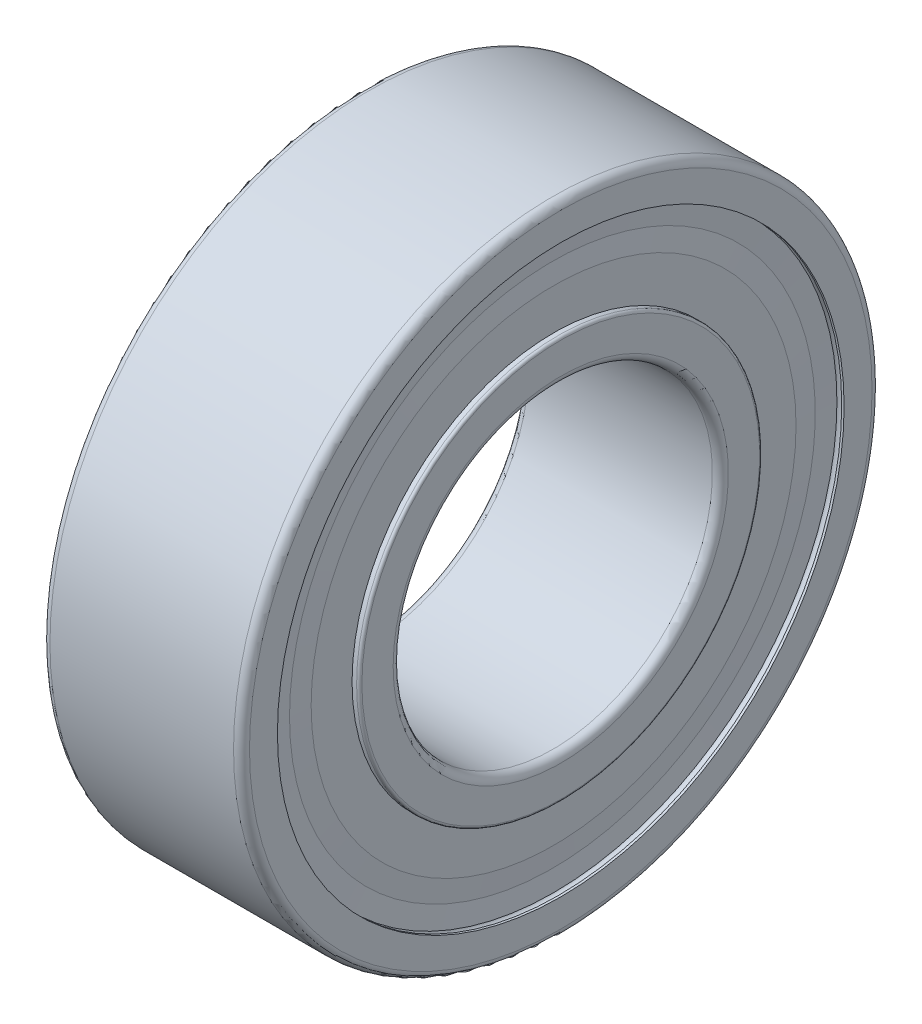
ISO-10303-21;
HEADER;
FILE_DESCRIPTION(('STEP AP214'),'2;1');
FILE_NAME('part.step','',(''),(''),'','','');
FILE_SCHEMA(('AUTOMOTIVE_DESIGN { 1 0 10303 214 1 1 1 1 }'));
ENDSEC;
DATA;
#1=APPLICATION_CONTEXT('core data for automotive mechanical design processes');
#2=APPLICATION_PROTOCOL_DEFINITION('international standard','automotive_design',2000,#1);
#3=PRODUCT_CONTEXT('',#1,'mechanical');
#4=PRODUCT('Part','Part','',(#3));
#5=PRODUCT_RELATED_PRODUCT_CATEGORY('part','',(#4));
#6=PRODUCT_DEFINITION_FORMATION('','',#4);
#7=PRODUCT_DEFINITION_CONTEXT('part definition',#1,'design');
#8=PRODUCT_DEFINITION('design','',#6,#7);
#9=PRODUCT_DEFINITION_SHAPE('','',#8);
#10=(LENGTH_UNIT() NAMED_UNIT(*) SI_UNIT(.MILLI.,.METRE.));
#11=(NAMED_UNIT(*) PLANE_ANGLE_UNIT() SI_UNIT($,.RADIAN.));
#12=(NAMED_UNIT(*) SI_UNIT($,.STERADIAN.) SOLID_ANGLE_UNIT());
#13=UNCERTAINTY_MEASURE_WITH_UNIT(LENGTH_MEASURE(1.E-05),#10,'distance_accuracy_value','');
#14=(GEOMETRIC_REPRESENTATION_CONTEXT(3) GLOBAL_UNCERTAINTY_ASSIGNED_CONTEXT((#13)) GLOBAL_UNIT_ASSIGNED_CONTEXT((#10,
#11,#12)) REPRESENTATION_CONTEXT('',''));
#15=CARTESIAN_POINT('',(0.,0.,0.));
#16=DIRECTION('',(0.,0.,1.));
#17=DIRECTION('',(1.,0.,0.));
#18=AXIS2_PLACEMENT_3D('',#15,#16,#17);
#19=CARTESIAN_POINT('',(2.5,1.03320665711823,-5.85960613042264));
#20=DIRECTION('',(-1.,0.,0.));
#21=DIRECTION('',(0.,0.17364817766693,-0.984807753012208));
#22=AXIS2_PLACEMENT_3D('',#19,#20,#21);
#23=SPHERICAL_SURFACE('',#22,1.1905);
#24=CARTESIAN_POINT('',(1.3095,1.03320665711823,-5.85960613042264));
#25=VERTEX_POINT('',#24);
#26=VERTEX_LOOP('',#25);
#27=FACE_BOUND('',#26,.T.);
#28=ADVANCED_FACE('P0_F12',(#27),#23,.T.);
#29=CLOSED_SHELL('',(#28));
#30=MANIFOLD_SOLID_BREP('P0_B1',#29);
#31=CARTESIAN_POINT('',(2.5,1.03320665711823,5.85960613042264));
#32=DIRECTION('',(-1.,0.,0.));
#33=DIRECTION('',(0.,0.17364817766693,0.984807753012208));
#34=AXIS2_PLACEMENT_3D('',#31,#32,#33);
#35=SPHERICAL_SURFACE('',#34,1.1905);
#36=CARTESIAN_POINT('',(1.3095,1.03320665711823,5.85960613042264));
#37=VERTEX_POINT('',#36);
#38=VERTEX_LOOP('',#37);
#39=FACE_BOUND('',#38,.T.);
#40=ADVANCED_FACE('P1_F12',(#39),#35,.T.);
#41=CLOSED_SHELL('',(#40));
#42=MANIFOLD_SOLID_BREP('P1_B1',#41);
#43=CARTESIAN_POINT('',(2.5,4.55796443655792,3.82458627763491));
#44=DIRECTION('',(-1.,0.,0.));
#45=DIRECTION('',(0.,0.766044443118978,0.642787609686539));
#46=AXIS2_PLACEMENT_3D('',#43,#44,#45);
#47=SPHERICAL_SURFACE('',#46,1.1905);
#48=CARTESIAN_POINT('',(1.3095,4.55796443655792,3.82458627763491));
#49=VERTEX_POINT('',#48);
#50=VERTEX_LOOP('',#49);
#51=FACE_BOUND('',#50,.T.);
#52=ADVANCED_FACE('P2_F12',(#51),#47,.T.);
#53=CLOSED_SHELL('',(#52));
#54=MANIFOLD_SOLID_BREP('P2_B1',#53);
#55=CARTESIAN_POINT('',(2.5,5.95,0.));
#56=DIRECTION('',(-1.,0.,0.));
#57=DIRECTION('',(0.,1.,0.));
#58=AXIS2_PLACEMENT_3D('',#55,#56,#57);
#59=SPHERICAL_SURFACE('',#58,1.1905);
#60=CARTESIAN_POINT('',(1.3095,5.95,0.));
#61=VERTEX_POINT('',#60);
#62=VERTEX_LOOP('',#61);
#63=FACE_BOUND('',#62,.T.);
#64=ADVANCED_FACE('P3_F12',(#63),#59,.T.);
#65=CLOSED_SHELL('',(#64));
#66=MANIFOLD_SOLID_BREP('P3_B1',#65);
#67=CARTESIAN_POINT('',(0.,7.8,0.));
#68=DIRECTION('',(1.,0.,0.));
#69=DIRECTION('',(0.,0.,-1.));
#70=AXIS2_PLACEMENT_3D('',#67,#68,#69);
#71=PLANE('',#70);
#72=CARTESIAN_POINT('',(0.,0.,0.));
#73=DIRECTION('',(-1.,0.,0.));
#74=DIRECTION('',(0.,0.,1.));
#75=AXIS2_PLACEMENT_3D('',#72,#73,#74);
#76=CIRCLE('',#75,7.1);
#77=CARTESIAN_POINT('',(0.,0.,7.1));
#78=VERTEX_POINT('',#77);
#79=EDGE_CURVE('P4_E60',#78,#78,#76,.T.);
#80=ORIENTED_EDGE('',*,*,#79,.F.);
#81=EDGE_LOOP('',(#80));
#82=FACE_BOUND('',#81,.T.);
#83=CARTESIAN_POINT('',(0.,0.,0.));
#84=DIRECTION('',(-1.,0.,0.));
#85=DIRECTION('',(0.,0.,1.));
#86=AXIS2_PLACEMENT_3D('',#83,#84,#85);
#87=CIRCLE('',#86,7.8);
#88=CARTESIAN_POINT('',(0.,0.,7.8));
#89=VERTEX_POINT('',#88);
#90=EDGE_CURVE('P4_E10',#89,#89,#87,.T.);
#91=ORIENTED_EDGE('',*,*,#90,.T.);
#92=EDGE_LOOP('',(#91));
#93=FACE_BOUND('',#92,.T.);
#94=ADVANCED_FACE('P4_F14',(#82,#93),#71,.F.);
#95=CARTESIAN_POINT('',(0.200000000000016,0.,0.));
#96=DIRECTION('',(-1.,0.,0.));
#97=DIRECTION('',(0.,0.,1.));
#98=AXIS2_PLACEMENT_3D('',#95,#96,#97);
#99=TOROIDAL_SURFACE('',#98,7.79999999999998,0.200000000000016);
#100=ORIENTED_EDGE('',*,*,#90,.F.);
#101=EDGE_LOOP('',(#100));
#102=FACE_BOUND('',#101,.T.);
#103=CARTESIAN_POINT('',(0.199999999999999,0.,0.));
#104=DIRECTION('',(-1.,0.,0.));
#105=DIRECTION('',(0.,0.,1.));
#106=AXIS2_PLACEMENT_3D('',#103,#104,#105);
#107=CIRCLE('',#106,8.);
#108=CARTESIAN_POINT('',(0.199999999999999,0.,8.));
#109=VERTEX_POINT('',#108);
#110=EDGE_CURVE('P4_E20',#109,#109,#107,.T.);
#111=ORIENTED_EDGE('',*,*,#110,.T.);
#112=EDGE_LOOP('',(#111));
#113=FACE_BOUND('',#112,.T.);
#114=ADVANCED_FACE('P4_F67',(#102,#113),#99,.T.);
#115=CARTESIAN_POINT('',(50.,0.,0.));
#116=DIRECTION('',(-1.,0.,0.));
#117=DIRECTION('',(0.,0.,1.));
#118=AXIS2_PLACEMENT_3D('',#115,#116,#117);
#119=CYLINDRICAL_SURFACE('',#118,8.);
#120=ORIENTED_EDGE('',*,*,#110,.F.);
#121=EDGE_LOOP('',(#120));
#122=FACE_BOUND('',#121,.T.);
#123=CARTESIAN_POINT('',(4.8,0.,0.));
#124=DIRECTION('',(-1.,0.,0.));
#125=DIRECTION('',(0.,0.,1.));
#126=AXIS2_PLACEMENT_3D('',#123,#124,#125);
#127=CIRCLE('',#126,8.);
#128=CARTESIAN_POINT('',(4.8,0.,8.));
#129=VERTEX_POINT('',#128);
#130=EDGE_CURVE('P4_E24',#129,#129,#127,.T.);
#131=ORIENTED_EDGE('',*,*,#130,.T.);
#132=EDGE_LOOP('',(#131));
#133=FACE_BOUND('',#132,.T.);
#134=ADVANCED_FACE('P4_F72',(#122,#133),#119,.T.);
#135=CARTESIAN_POINT('',(4.79999999999997,0.,0.));
#136=DIRECTION('',(-1.,0.,0.));
#137=DIRECTION('',(0.,0.,1.));
#138=AXIS2_PLACEMENT_3D('',#135,#136,#137);
#139=TOROIDAL_SURFACE('',#138,7.79999999999997,0.200000000000031);
#140=ORIENTED_EDGE('',*,*,#130,.F.);
#141=EDGE_LOOP('',(#140));
#142=FACE_BOUND('',#141,.T.);
#143=CARTESIAN_POINT('',(5.,0.,0.));
#144=DIRECTION('',(-1.,0.,0.));
#145=DIRECTION('',(0.,0.,1.));
#146=AXIS2_PLACEMENT_3D('',#143,#144,#145);
#147=CIRCLE('',#146,7.8);
#148=CARTESIAN_POINT('',(5.,0.,7.8));
#149=VERTEX_POINT('',#148);
#150=EDGE_CURVE('P4_E28',#149,#149,#147,.T.);
#151=ORIENTED_EDGE('',*,*,#150,.T.);
#152=EDGE_LOOP('',(#151));
#153=FACE_BOUND('',#152,.T.);
#154=ADVANCED_FACE('P4_F77',(#142,#153),#139,.T.);
#155=CARTESIAN_POINT('',(5.,7.1,0.));
#156=DIRECTION('',(-1.,0.,0.));
#157=DIRECTION('',(0.,0.,1.));
#158=AXIS2_PLACEMENT_3D('',#155,#156,#157);
#159=PLANE('',#158);
#160=ORIENTED_EDGE('',*,*,#150,.F.);
#161=EDGE_LOOP('',(#160));
#162=FACE_BOUND('',#161,.T.);
#163=CARTESIAN_POINT('',(5.,0.,0.));
#164=DIRECTION('',(-1.,0.,0.));
#165=DIRECTION('',(0.,0.,1.));
#166=AXIS2_PLACEMENT_3D('',#163,#164,#165);
#167=CIRCLE('',#166,7.1);
#168=CARTESIAN_POINT('',(5.,0.,7.1));
#169=VERTEX_POINT('',#168);
#170=EDGE_CURVE('P4_E33',#169,#169,#167,.T.);
#171=ORIENTED_EDGE('',*,*,#170,.T.);
#172=EDGE_LOOP('',(#171));
#173=FACE_BOUND('',#172,.T.);
#174=ADVANCED_FACE('P4_F83',(#162,#173),#159,.F.);
#175=CARTESIAN_POINT('',(50.,0.,0.));
#176=DIRECTION('',(-1.,0.,0.));
#177=DIRECTION('',(0.,0.,1.));
#178=AXIS2_PLACEMENT_3D('',#175,#176,#177);
#179=CYLINDRICAL_SURFACE('',#178,7.1);
#180=ORIENTED_EDGE('',*,*,#170,.F.);
#181=EDGE_LOOP('',(#180));
#182=FACE_BOUND('',#181,.T.);
#183=CARTESIAN_POINT('',(4.94,0.,0.));
#184=DIRECTION('',(-1.,0.,0.));
#185=DIRECTION('',(0.,0.,1.));
#186=AXIS2_PLACEMENT_3D('',#183,#184,#185);
#187=CIRCLE('',#186,7.1);
#188=CARTESIAN_POINT('',(4.94,0.,7.1));
#189=VERTEX_POINT('',#188);
#190=EDGE_CURVE('P4_E36',#189,#189,#187,.T.);
#191=ORIENTED_EDGE('',*,*,#190,.T.);
#192=EDGE_LOOP('',(#191));
#193=FACE_BOUND('',#192,.T.);
#194=ADVANCED_FACE('P4_F87',(#182,#193),#179,.F.);
#195=CARTESIAN_POINT('',(4.82,0.,0.));
#196=DIRECTION('',(-1.,0.,0.));
#197=DIRECTION('',(0.,0.,1.));
#198=AXIS2_PLACEMENT_3D('',#195,#196,#197);
#199=TOROIDAL_SURFACE('',#198,7.1,0.12);
#200=ORIENTED_EDGE('',*,*,#190,.F.);
#201=EDGE_LOOP('',(#200));
#202=FACE_BOUND('',#201,.T.);
#203=CARTESIAN_POINT('',(4.7,0.,0.));
#204=DIRECTION('',(-1.,0.,0.));
#205=DIRECTION('',(0.,0.,1.));
#206=AXIS2_PLACEMENT_3D('',#203,#204,#205);
#207=CIRCLE('',#206,7.1);
#208=CARTESIAN_POINT('',(4.7,0.,7.1));
#209=VERTEX_POINT('',#208);
#210=EDGE_CURVE('P4_E39',#209,#209,#207,.T.);
#211=ORIENTED_EDGE('',*,*,#210,.T.);
#212=EDGE_LOOP('',(#211));
#213=FACE_BOUND('',#212,.T.);
#214=ADVANCED_FACE('P4_F91',(#202,#213),#199,.F.);
#215=CARTESIAN_POINT('',(4.6471019057875,0.,0.));
#216=DIRECTION('',(1.,0.,0.));
#217=DIRECTION('',(0.,0.,-1.));
#218=AXIS2_PLACEMENT_3D('',#215,#216,#217);
#219=CONICAL_SURFACE('',#218,6.8,1.39626340159559);
#220=ORIENTED_EDGE('',*,*,#210,.F.);
#221=EDGE_LOOP('',(#220));
#222=FACE_BOUND('',#221,.T.);
#223=CARTESIAN_POINT('',(4.6471019057875,0.,0.));
#224=DIRECTION('',(-1.,0.,0.));
#225=DIRECTION('',(0.,0.,1.));
#226=AXIS2_PLACEMENT_3D('',#223,#224,#225);
#227=CIRCLE('',#226,6.8);
#228=CARTESIAN_POINT('',(4.6471019057875,0.,6.8));
#229=VERTEX_POINT('',#228);
#230=EDGE_CURVE('P4_E42',#229,#229,#227,.T.);
#231=ORIENTED_EDGE('',*,*,#230,.T.);
#232=EDGE_LOOP('',(#231));
#233=FACE_BOUND('',#232,.T.);
#234=ADVANCED_FACE('P4_F95',(#222,#233),#219,.F.);
#235=CARTESIAN_POINT('',(50.,0.,0.));
#236=DIRECTION('',(-1.,0.,0.));
#237=DIRECTION('',(0.,0.,1.));
#238=AXIS2_PLACEMENT_3D('',#235,#236,#237);
#239=CYLINDRICAL_SURFACE('',#238,6.8);
#240=ORIENTED_EDGE('',*,*,#230,.F.);
#241=EDGE_LOOP('',(#240));
#242=FACE_BOUND('',#241,.T.);
#243=CARTESIAN_POINT('',(3.3335407908435,0.,0.));
#244=DIRECTION('',(-1.,0.,0.));
#245=DIRECTION('',(0.,0.,1.));
#246=AXIS2_PLACEMENT_3D('',#243,#244,#245);
#247=CIRCLE('',#246,6.8);
#248=CARTESIAN_POINT('',(3.3335407908435,0.,6.8));
#249=VERTEX_POINT('',#248);
#250=EDGE_CURVE('P4_E45',#249,#249,#247,.T.);
#251=ORIENTED_EDGE('',*,*,#250,.T.);
#252=EDGE_LOOP('',(#251));
#253=FACE_BOUND('',#252,.T.);
#254=ADVANCED_FACE('P4_F99',(#242,#253),#239,.F.);
#255=CARTESIAN_POINT('',(2.5,0.,0.));
#256=DIRECTION('',(-1.,0.,0.));
#257=DIRECTION('',(0.,0.,1.));
#258=AXIS2_PLACEMENT_3D('',#255,#256,#257);
#259=TOROIDAL_SURFACE('',#258,5.94999999999999,1.19050000000001);
#260=ORIENTED_EDGE('',*,*,#250,.F.);
#261=EDGE_LOOP('',(#260));
#262=FACE_BOUND('',#261,.T.);
#263=CARTESIAN_POINT('',(1.6664592091565,0.,0.));
#264=DIRECTION('',(-1.,0.,0.));
#265=DIRECTION('',(0.,0.,1.));
#266=AXIS2_PLACEMENT_3D('',#263,#264,#265);
#267=CIRCLE('',#266,6.8);
#268=CARTESIAN_POINT('',(1.6664592091565,0.,6.8));
#269=VERTEX_POINT('',#268);
#270=EDGE_CURVE('P4_E48',#269,#269,#267,.T.);
#271=ORIENTED_EDGE('',*,*,#270,.T.);
#272=EDGE_LOOP('',(#271));
#273=FACE_BOUND('',#272,.T.);
#274=ADVANCED_FACE('P4_F103',(#262,#273),#259,.F.);
#275=CARTESIAN_POINT('',(50.,0.,0.));
#276=DIRECTION('',(-1.,0.,0.));
#277=DIRECTION('',(0.,0.,1.));
#278=AXIS2_PLACEMENT_3D('',#275,#276,#277);
#279=CYLINDRICAL_SURFACE('',#278,6.8);
#280=ORIENTED_EDGE('',*,*,#270,.F.);
#281=EDGE_LOOP('',(#280));
#282=FACE_BOUND('',#281,.T.);
#283=CARTESIAN_POINT('',(0.352898094212538,0.,0.));
#284=DIRECTION('',(-1.,0.,0.));
#285=DIRECTION('',(0.,0.,1.));
#286=AXIS2_PLACEMENT_3D('',#283,#284,#285);
#287=CIRCLE('',#286,6.8);
#288=CARTESIAN_POINT('',(0.352898094212538,0.,6.8));
#289=VERTEX_POINT('',#288);
#290=EDGE_CURVE('P4_E51',#289,#289,#287,.T.);
#291=ORIENTED_EDGE('',*,*,#290,.T.);
#292=EDGE_LOOP('',(#291));
#293=FACE_BOUND('',#292,.T.);
#294=ADVANCED_FACE('P4_F107',(#282,#293),#279,.F.);
#295=CARTESIAN_POINT('',(0.300000000000002,0.,0.));
#296=DIRECTION('',(-1.,0.,0.));
#297=DIRECTION('',(0.,0.,1.));
#298=AXIS2_PLACEMENT_3D('',#295,#296,#297);
#299=CONICAL_SURFACE('',#298,7.1,1.39626340159547);
#300=ORIENTED_EDGE('',*,*,#290,.F.);
#301=EDGE_LOOP('',(#300));
#302=FACE_BOUND('',#301,.T.);
#303=CARTESIAN_POINT('',(0.300000000000002,0.,0.));
#304=DIRECTION('',(-1.,0.,0.));
#305=DIRECTION('',(0.,0.,1.));
#306=AXIS2_PLACEMENT_3D('',#303,#304,#305);
#307=CIRCLE('',#306,7.1);
#308=CARTESIAN_POINT('',(0.300000000000002,0.,7.1));
#309=VERTEX_POINT('',#308);
#310=EDGE_CURVE('P4_E54',#309,#309,#307,.T.);
#311=ORIENTED_EDGE('',*,*,#310,.T.);
#312=EDGE_LOOP('',(#311));
#313=FACE_BOUND('',#312,.T.);
#314=ADVANCED_FACE('P4_F111',(#302,#313),#299,.F.);
#315=CARTESIAN_POINT('',(0.18,0.,0.));
#316=DIRECTION('',(-1.,0.,0.));
#317=DIRECTION('',(0.,0.,1.));
#318=AXIS2_PLACEMENT_3D('',#315,#316,#317);
#319=TOROIDAL_SURFACE('',#318,7.1,0.12);
#320=ORIENTED_EDGE('',*,*,#310,.F.);
#321=EDGE_LOOP('',(#320));
#322=FACE_BOUND('',#321,.T.);
#323=CARTESIAN_POINT('',(0.0599999999999976,0.,0.));
#324=DIRECTION('',(-1.,0.,0.));
#325=DIRECTION('',(0.,0.,1.));
#326=AXIS2_PLACEMENT_3D('',#323,#324,#325);
#327=CIRCLE('',#326,7.1);
#328=CARTESIAN_POINT('',(0.0599999999999976,0.,7.1));
#329=VERTEX_POINT('',#328);
#330=EDGE_CURVE('P4_E57',#329,#329,#327,.T.);
#331=ORIENTED_EDGE('',*,*,#330,.T.);
#332=EDGE_LOOP('',(#331));
#333=FACE_BOUND('',#332,.T.);
#334=ADVANCED_FACE('P4_F115',(#322,#333),#319,.F.);
#335=CARTESIAN_POINT('',(50.,0.,0.));
#336=DIRECTION('',(-1.,0.,0.));
#337=DIRECTION('',(0.,0.,1.));
#338=AXIS2_PLACEMENT_3D('',#335,#336,#337);
#339=CYLINDRICAL_SURFACE('',#338,7.1);
#340=ORIENTED_EDGE('',*,*,#330,.F.);
#341=EDGE_LOOP('',(#340));
#342=FACE_BOUND('',#341,.T.);
#343=ORIENTED_EDGE('',*,*,#79,.T.);
#344=EDGE_LOOP('',(#343));
#345=FACE_BOUND('',#344,.T.);
#346=ADVANCED_FACE('P4_F64',(#342,#345),#339,.F.);
#347=CLOSED_SHELL('',(#94,#114,#134,#154,#174,#194,#214,#234,#254,#274,#294,#314,#334,#346));
#348=MANIFOLD_SOLID_BREP('P4_B1',#347);
#349=CARTESIAN_POINT('',(50.,0.,0.));
#350=DIRECTION('',(-1.,0.,0.));
#351=DIRECTION('',(0.,0.,1.));
#352=AXIS2_PLACEMENT_3D('',#349,#350,#351);
#353=CYLINDRICAL_SURFACE('',#352,5.05);
#354=CARTESIAN_POINT('',(3.2792882971019,0.,0.));
#355=DIRECTION('',(-1.,0.,0.));
#356=DIRECTION('',(0.,0.,1.));
#357=AXIS2_PLACEMENT_3D('',#354,#355,#356);
#358=CIRCLE('',#357,5.05);
#359=CARTESIAN_POINT('',(3.2792882971019,0.,5.05));
#360=VERTEX_POINT('',#359);
#361=EDGE_CURVE('P5_E55',#360,#360,#358,.T.);
#362=ORIENTED_EDGE('',*,*,#361,.F.);
#363=EDGE_LOOP('',(#362));
#364=FACE_BOUND('',#363,.T.);
#365=CARTESIAN_POINT('',(4.76,0.,0.));
#366=DIRECTION('',(-1.,0.,0.));
#367=DIRECTION('',(0.,0.,1.));
#368=AXIS2_PLACEMENT_3D('',#365,#366,#367);
#369=CIRCLE('',#368,5.05);
#370=CARTESIAN_POINT('',(4.76,0.,5.05));
#371=VERTEX_POINT('',#370);
#372=EDGE_CURVE('P5_E10',#371,#371,#369,.F.);
#373=ORIENTED_EDGE('',*,*,#372,.F.);
#374=EDGE_LOOP('',(#373));
#375=FACE_BOUND('',#374,.T.);
#376=ADVANCED_FACE('P5_F14',(#364,#375),#353,.T.);
#377=CARTESIAN_POINT('',(4.9333333333333,0.,0.));
#378=DIRECTION('',(-1.,0.,0.));
#379=DIRECTION('',(0.,0.,1.));
#380=AXIS2_PLACEMENT_3D('',#377,#378,#379);
#381=CIRCLE('',#380,5.05);
#382=CARTESIAN_POINT('',(4.9333333333333,0.,5.05));
#383=VERTEX_POINT('',#382);
#384=EDGE_CURVE('P5_E52',#383,#383,#381,.T.);
#385=ORIENTED_EDGE('',*,*,#384,.T.);
#386=EDGE_LOOP('',(#385));
#387=FACE_BOUND('',#386,.T.);
#388=CARTESIAN_POINT('',(4.82,0.,0.));
#389=DIRECTION('',(-1.,0.,0.));
#390=DIRECTION('',(0.,0.,1.));
#391=AXIS2_PLACEMENT_3D('',#388,#389,#390);
#392=CIRCLE('',#391,5.05);
#393=CARTESIAN_POINT('',(4.82,0.,5.05));
#394=VERTEX_POINT('',#393);
#395=EDGE_CURVE('P5_E21',#394,#394,#392,.T.);
#396=ORIENTED_EDGE('',*,*,#395,.F.);
#397=EDGE_LOOP('',(#396));
#398=FACE_BOUND('',#397,.T.);
#399=ADVANCED_FACE('P5_F133',(#387,#398),#353,.T.);
#400=CARTESIAN_POINT('',(50.,0.,0.));
#401=DIRECTION('',(-1.,0.,0.));
#402=DIRECTION('',(0.,0.,1.));
#403=AXIS2_PLACEMENT_3D('',#400,#401,#402);
#404=CYLINDRICAL_SURFACE('',#403,5.05);
#405=CARTESIAN_POINT('',(0.0666666666666663,0.,0.));
#406=DIRECTION('',(-1.,0.,0.));
#407=DIRECTION('',(0.,0.,1.));
#408=AXIS2_PLACEMENT_3D('',#405,#406,#407);
#409=CIRCLE('',#408,5.05);
#410=CARTESIAN_POINT('',(0.0666666666666663,0.,5.05));
#411=VERTEX_POINT('',#410);
#412=EDGE_CURVE('P5_E61',#411,#411,#409,.T.);
#413=ORIENTED_EDGE('',*,*,#412,.F.);
#414=EDGE_LOOP('',(#413));
#415=FACE_BOUND('',#414,.T.);
#416=CARTESIAN_POINT('',(0.18,0.,0.));
#417=DIRECTION('',(1.,0.,0.));
#418=DIRECTION('',(0.,0.,-1.));
#419=AXIS2_PLACEMENT_3D('',#416,#417,#418);
#420=CIRCLE('',#419,5.05);
#421=CARTESIAN_POINT('',(0.18,0.,-5.05));
#422=VERTEX_POINT('',#421);
#423=EDGE_CURVE('P5_E25',#422,#422,#420,.T.);
#424=ORIENTED_EDGE('',*,*,#423,.F.);
#425=EDGE_LOOP('',(#424));
#426=FACE_BOUND('',#425,.T.);
#427=ADVANCED_FACE('P5_F140',(#415,#426),#404,.T.);
#428=CARTESIAN_POINT('',(1.7207117028981,0.,0.));
#429=DIRECTION('',(-1.,0.,0.));
#430=DIRECTION('',(0.,0.,1.));
#431=AXIS2_PLACEMENT_3D('',#428,#429,#430);
#432=CIRCLE('',#431,5.05);
#433=CARTESIAN_POINT('',(1.7207117028981,0.,5.05));
#434=VERTEX_POINT('',#433);
#435=EDGE_CURVE('P5_E58',#434,#434,#432,.T.);
#436=ORIENTED_EDGE('',*,*,#435,.T.);
#437=EDGE_LOOP('',(#436));
#438=FACE_BOUND('',#437,.T.);
#439=CARTESIAN_POINT('',(0.239999999999997,0.,0.));
#440=DIRECTION('',(1.,0.,0.));
#441=DIRECTION('',(0.,0.,-1.));
#442=AXIS2_PLACEMENT_3D('',#439,#440,#441);
#443=CIRCLE('',#442,5.05);
#444=CARTESIAN_POINT('',(0.239999999999997,0.,-5.05));
#445=VERTEX_POINT('',#444);
#446=EDGE_CURVE('P5_E29',#445,#445,#443,.F.);
#447=ORIENTED_EDGE('',*,*,#446,.F.);
#448=EDGE_LOOP('',(#447));
#449=FACE_BOUND('',#448,.T.);
#450=ADVANCED_FACE('P5_F173',(#438,#449),#404,.T.);
#451=CARTESIAN_POINT('',(0.0666666666667297,0.,0.));
#452=DIRECTION('',(-1.,0.,0.));
#453=DIRECTION('',(0.,0.,1.));
#454=AXIS2_PLACEMENT_3D('',#451,#452,#453);
#455=TOROIDAL_SURFACE('',#454,4.98333333333327,0.0666666666667296);
#456=CARTESIAN_POINT('',(0.,0.,0.));
#457=DIRECTION('',(-1.,0.,0.));
#458=DIRECTION('',(0.,0.,1.));
#459=AXIS2_PLACEMENT_3D('',#456,#457,#458);
#460=CIRCLE('',#459,4.9833333333333);
#461=CARTESIAN_POINT('',(0.,0.,4.9833333333333));
#462=VERTEX_POINT('',#461);
#463=EDGE_CURVE('P5_E34',#462,#462,#460,.T.);
#464=ORIENTED_EDGE('',*,*,#463,.F.);
#465=EDGE_LOOP('',(#464));
#466=FACE_BOUND('',#465,.T.);
#467=ORIENTED_EDGE('',*,*,#412,.T.);
#468=EDGE_LOOP('',(#467));
#469=FACE_BOUND('',#468,.T.);
#470=ADVANCED_FACE('P5_F16',(#466,#469),#455,.T.);
#471=CARTESIAN_POINT('',(0.,4.9833333333333,0.));
#472=DIRECTION('',(1.,0.,0.));
#473=DIRECTION('',(0.,0.,-1.));
#474=AXIS2_PLACEMENT_3D('',#471,#472,#473);
#475=PLANE('',#474);
#476=CARTESIAN_POINT('',(0.,0.,0.));
#477=DIRECTION('',(-1.,0.,0.));
#478=DIRECTION('',(0.,0.,1.));
#479=AXIS2_PLACEMENT_3D('',#476,#477,#478);
#480=CIRCLE('',#479,4.2);
#481=CARTESIAN_POINT('',(0.,0.,4.2));
#482=VERTEX_POINT('',#481);
#483=EDGE_CURVE('P5_E37',#482,#482,#480,.T.);
#484=ORIENTED_EDGE('',*,*,#483,.F.);
#485=EDGE_LOOP('',(#484));
#486=FACE_BOUND('',#485,.T.);
#487=ORIENTED_EDGE('',*,*,#463,.T.);
#488=EDGE_LOOP('',(#487));
#489=FACE_BOUND('',#488,.T.);
#490=ADVANCED_FACE('P5_F166',(#486,#489),#475,.F.);
#491=CARTESIAN_POINT('',(0.200000000000016,0.,0.));
#492=DIRECTION('',(-1.,0.,0.));
#493=DIRECTION('',(0.,0.,1.));
#494=AXIS2_PLACEMENT_3D('',#491,#492,#493);
#495=TOROIDAL_SURFACE('',#494,4.20000000000002,0.200000000000016);
#496=CARTESIAN_POINT('',(0.199999999999999,0.,0.));
#497=DIRECTION('',(-1.,0.,0.));
#498=DIRECTION('',(0.,0.,1.));
#499=AXIS2_PLACEMENT_3D('',#496,#497,#498);
#500=CIRCLE('',#499,4.);
#501=CARTESIAN_POINT('',(0.199999999999999,0.,4.));
#502=VERTEX_POINT('',#501);
#503=EDGE_CURVE('P5_E40',#502,#502,#500,.T.);
#504=ORIENTED_EDGE('',*,*,#503,.F.);
#505=EDGE_LOOP('',(#504));
#506=FACE_BOUND('',#505,.T.);
#507=ORIENTED_EDGE('',*,*,#483,.T.);
#508=EDGE_LOOP('',(#507));
#509=FACE_BOUND('',#508,.T.);
#510=ADVANCED_FACE('P5_F163',(#506,#509),#495,.T.);
#511=CARTESIAN_POINT('',(50.,0.,0.));
#512=DIRECTION('',(-1.,0.,0.));
#513=DIRECTION('',(0.,0.,1.));
#514=AXIS2_PLACEMENT_3D('',#511,#512,#513);
#515=CYLINDRICAL_SURFACE('',#514,4.);
#516=CARTESIAN_POINT('',(4.8,0.,0.));
#517=DIRECTION('',(-1.,0.,0.));
#518=DIRECTION('',(0.,0.,1.));
#519=AXIS2_PLACEMENT_3D('',#516,#517,#518);
#520=CIRCLE('',#519,4.);
#521=CARTESIAN_POINT('',(4.8,0.,4.));
#522=VERTEX_POINT('',#521);
#523=EDGE_CURVE('P5_E43',#522,#522,#520,.T.);
#524=ORIENTED_EDGE('',*,*,#523,.F.);
#525=EDGE_LOOP('',(#524));
#526=FACE_BOUND('',#525,.T.);
#527=ORIENTED_EDGE('',*,*,#503,.T.);
#528=EDGE_LOOP('',(#527));
#529=FACE_BOUND('',#528,.T.);
#530=ADVANCED_FACE('P5_F159',(#526,#529),#515,.F.);
#531=CARTESIAN_POINT('',(4.79999999999997,0.,0.));
#532=DIRECTION('',(-1.,0.,0.));
#533=DIRECTION('',(0.,0.,1.));
#534=AXIS2_PLACEMENT_3D('',#531,#532,#533);
#535=TOROIDAL_SURFACE('',#534,4.20000000000003,0.200000000000031);
#536=CARTESIAN_POINT('',(5.,0.,0.));
#537=DIRECTION('',(-1.,0.,0.));
#538=DIRECTION('',(0.,0.,1.));
#539=AXIS2_PLACEMENT_3D('',#536,#537,#538);
#540=CIRCLE('',#539,4.20000000000003);
#541=CARTESIAN_POINT('',(5.,0.,4.20000000000003));
#542=VERTEX_POINT('',#541);
#543=EDGE_CURVE('P5_E46',#542,#542,#540,.T.);
#544=ORIENTED_EDGE('',*,*,#543,.F.);
#545=EDGE_LOOP('',(#544));
#546=FACE_BOUND('',#545,.T.);
#547=ORIENTED_EDGE('',*,*,#523,.T.);
#548=EDGE_LOOP('',(#547));
#549=FACE_BOUND('',#548,.T.);
#550=ADVANCED_FACE('P5_F155',(#546,#549),#535,.T.);
#551=CARTESIAN_POINT('',(5.,4.2,0.));
#552=DIRECTION('',(-1.,0.,0.));
#553=DIRECTION('',(0.,0.,1.));
#554=AXIS2_PLACEMENT_3D('',#551,#552,#553);
#555=PLANE('',#554);
#556=CARTESIAN_POINT('',(5.,0.,0.));
#557=DIRECTION('',(-1.,0.,0.));
#558=DIRECTION('',(0.,0.,1.));
#559=AXIS2_PLACEMENT_3D('',#556,#557,#558);
#560=CIRCLE('',#559,4.9833333333333);
#561=CARTESIAN_POINT('',(5.,0.,4.9833333333333));
#562=VERTEX_POINT('',#561);
#563=EDGE_CURVE('P5_E49',#562,#562,#560,.T.);
#564=ORIENTED_EDGE('',*,*,#563,.F.);
#565=EDGE_LOOP('',(#564));
#566=FACE_BOUND('',#565,.T.);
#567=ORIENTED_EDGE('',*,*,#543,.T.);
#568=EDGE_LOOP('',(#567));
#569=FACE_BOUND('',#568,.T.);
#570=ADVANCED_FACE('P5_F151',(#566,#569),#555,.F.);
#571=CARTESIAN_POINT('',(4.93333333333321,0.,0.));
#572=DIRECTION('',(-1.,0.,0.));
#573=DIRECTION('',(0.,0.,1.));
#574=AXIS2_PLACEMENT_3D('',#571,#572,#573);
#575=TOROIDAL_SURFACE('',#574,4.98333333333321,0.0666666666667903);
#576=ORIENTED_EDGE('',*,*,#384,.F.);
#577=EDGE_LOOP('',(#576));
#578=FACE_BOUND('',#577,.T.);
#579=ORIENTED_EDGE('',*,*,#563,.T.);
#580=EDGE_LOOP('',(#579));
#581=FACE_BOUND('',#580,.T.);
#582=ADVANCED_FACE('P5_F148',(#578,#581),#575,.T.);
#583=CARTESIAN_POINT('',(2.5,0.,0.));
#584=DIRECTION('',(-1.,0.,0.));
#585=DIRECTION('',(0.,0.,1.));
#586=AXIS2_PLACEMENT_3D('',#583,#584,#585);
#587=TOROIDAL_SURFACE('',#586,5.94999999999996,1.19049999999996);
#588=ORIENTED_EDGE('',*,*,#435,.F.);
#589=EDGE_LOOP('',(#588));
#590=FACE_BOUND('',#589,.T.);
#591=ORIENTED_EDGE('',*,*,#361,.T.);
#592=EDGE_LOOP('',(#591));
#593=FACE_BOUND('',#592,.T.);
#594=ADVANCED_FACE('P5_F146',(#590,#593),#587,.F.);
#595=CARTESIAN_POINT('',(50.,0.,0.));
#596=DIRECTION('',(-1.,0.,0.));
#597=DIRECTION('',(0.,0.,1.));
#598=AXIS2_PLACEMENT_3D('',#595,#596,#597);
#599=CYLINDRICAL_SURFACE('',#598,7.1);
#600=CARTESIAN_POINT('',(0.18,0.,0.));
#601=DIRECTION('',(-1.,0.,0.));
#602=DIRECTION('',(0.,0.,1.));
#603=AXIS2_PLACEMENT_3D('',#600,#601,#602);
#604=CIRCLE('',#603,7.1);
#605=CARTESIAN_POINT('',(0.18,0.,7.1));
#606=VERTEX_POINT('',#605);
#607=EDGE_CURVE('P5_E64',#606,#606,#604,.T.);
#608=ORIENTED_EDGE('',*,*,#607,.F.);
#609=EDGE_LOOP('',(#608));
#610=FACE_BOUND('',#609,.T.);
#611=CARTESIAN_POINT('',(0.239999999999997,0.,0.));
#612=DIRECTION('',(-1.,0.,0.));
#613=DIRECTION('',(0.,0.,1.));
#614=AXIS2_PLACEMENT_3D('',#611,#612,#613);
#615=CIRCLE('',#614,7.1);
#616=CARTESIAN_POINT('',(0.239999999999997,0.,7.1));
#617=VERTEX_POINT('',#616);
#618=EDGE_CURVE('P5_E79',#617,#617,#615,.T.);
#619=ORIENTED_EDGE('',*,*,#618,.T.);
#620=EDGE_LOOP('',(#619));
#621=FACE_BOUND('',#620,.T.);
#622=ADVANCED_FACE('P5_F200',(#610,#621),#599,.T.);
#623=CARTESIAN_POINT('',(0.18,0.,0.));
#624=DIRECTION('',(-1.,0.,0.));
#625=DIRECTION('',(0.,0.,1.));
#626=AXIS2_PLACEMENT_3D('',#623,#624,#625);
#627=CONICAL_SURFACE('',#626,7.1,1.51232646346514);
#628=CARTESIAN_POINT('',(0.210000000000002,0.,0.));
#629=DIRECTION('',(-1.,0.,0.));
#630=DIRECTION('',(0.,0.,1.));
#631=AXIS2_PLACEMENT_3D('',#628,#629,#630);
#632=CIRCLE('',#631,6.5875);
#633=CARTESIAN_POINT('',(0.210000000000002,0.,6.5875));
#634=VERTEX_POINT('',#633);
#635=EDGE_CURVE('P5_E67',#634,#634,#632,.T.);
#636=ORIENTED_EDGE('',*,*,#635,.F.);
#637=EDGE_LOOP('',(#636));
#638=FACE_BOUND('',#637,.T.);
#639=ORIENTED_EDGE('',*,*,#607,.T.);
#640=EDGE_LOOP('',(#639));
#641=FACE_BOUND('',#640,.T.);
#642=ADVANCED_FACE('P5_F195',(#638,#641),#627,.F.);
#643=CARTESIAN_POINT('',(0.210000000000002,0.,0.));
#644=DIRECTION('',(1.,0.,0.));
#645=DIRECTION('',(0.,0.,-1.));
#646=AXIS2_PLACEMENT_3D('',#643,#644,#645);
#647=CONICAL_SURFACE('',#646,6.5875,1.51232646346514);
#648=CARTESIAN_POINT('',(0.18,0.,0.));
#649=DIRECTION('',(-1.,0.,0.));
#650=DIRECTION('',(0.,0.,1.));
#651=AXIS2_PLACEMENT_3D('',#648,#649,#650);
#652=CIRCLE('',#651,6.075);
#653=CARTESIAN_POINT('',(0.18,0.,6.075));
#654=VERTEX_POINT('',#653);
#655=EDGE_CURVE('P5_E70',#654,#654,#652,.T.);
#656=ORIENTED_EDGE('',*,*,#655,.F.);
#657=EDGE_LOOP('',(#656));
#658=FACE_BOUND('',#657,.T.);
#659=ORIENTED_EDGE('',*,*,#635,.T.);
#660=EDGE_LOOP('',(#659));
#661=FACE_BOUND('',#660,.T.);
#662=ADVANCED_FACE('P5_F189',(#658,#661),#647,.T.);
#663=CARTESIAN_POINT('',(0.18,6.075,0.));
#664=DIRECTION('',(1.,0.,0.));
#665=DIRECTION('',(0.,0.,-1.));
#666=AXIS2_PLACEMENT_3D('',#663,#664,#665);
#667=PLANE('',#666);
#668=ORIENTED_EDGE('',*,*,#423,.T.);
#669=EDGE_LOOP('',(#668));
#670=FACE_BOUND('',#669,.T.);
#671=ORIENTED_EDGE('',*,*,#655,.T.);
#672=EDGE_LOOP('',(#671));
#673=FACE_BOUND('',#672,.T.);
#674=ADVANCED_FACE('P5_F185',(#670,#673),#667,.F.);
#675=CARTESIAN_POINT('',(0.239999999999997,0.,0.));
#676=DIRECTION('',(1.,0.,0.));
#677=DIRECTION('',(0.,0.,-1.));
#678=AXIS2_PLACEMENT_3D('',#675,#676,#677);
#679=CONICAL_SURFACE('',#678,5.05,1.51232646346514);
#680=CARTESIAN_POINT('',(0.300000000000002,0.,0.));
#681=DIRECTION('',(-1.,0.,0.));
#682=DIRECTION('',(0.,0.,1.));
#683=AXIS2_PLACEMENT_3D('',#680,#681,#682);
#684=CIRCLE('',#683,6.075);
#685=CARTESIAN_POINT('',(0.300000000000002,0.,6.075));
#686=VERTEX_POINT('',#685);
#687=EDGE_CURVE('P5_E73',#686,#686,#684,.T.);
#688=ORIENTED_EDGE('',*,*,#687,.F.);
#689=EDGE_LOOP('',(#688));
#690=FACE_BOUND('',#689,.T.);
#691=ORIENTED_EDGE('',*,*,#446,.T.);
#692=EDGE_LOOP('',(#691));
#693=FACE_BOUND('',#692,.T.);
#694=ADVANCED_FACE('P5_F188',(#690,#693),#679,.F.);
#695=CARTESIAN_POINT('',(0.3,6.075,0.));
#696=DIRECTION('',(-1.,0.,0.));
#697=DIRECTION('',(0.,0.,1.));
#698=AXIS2_PLACEMENT_3D('',#695,#696,#697);
#699=PLANE('',#698);
#700=CARTESIAN_POINT('',(0.300000000000002,0.,0.));
#701=DIRECTION('',(-1.,0.,0.));
#702=DIRECTION('',(0.,0.,1.));
#703=AXIS2_PLACEMENT_3D('',#700,#701,#702);
#704=CIRCLE('',#703,6.5875);
#705=CARTESIAN_POINT('',(0.300000000000002,0.,6.5875));
#706=VERTEX_POINT('',#705);
#707=EDGE_CURVE('P5_E76',#706,#706,#704,.T.);
#708=ORIENTED_EDGE('',*,*,#707,.F.);
#709=EDGE_LOOP('',(#708));
#710=FACE_BOUND('',#709,.T.);
#711=ORIENTED_EDGE('',*,*,#687,.T.);
#712=EDGE_LOOP('',(#711));
#713=FACE_BOUND('',#712,.T.);
#714=ADVANCED_FACE('P5_F212',(#710,#713),#699,.F.);
#715=CARTESIAN_POINT('',(0.300000000000002,0.,0.));
#716=DIRECTION('',(-1.,0.,0.));
#717=DIRECTION('',(0.,0.,1.));
#718=AXIS2_PLACEMENT_3D('',#715,#716,#717);
#719=CONICAL_SURFACE('',#718,6.5875,1.45425367330823);
#720=ORIENTED_EDGE('',*,*,#618,.F.);
#721=EDGE_LOOP('',(#720));
#722=FACE_BOUND('',#721,.T.);
#723=ORIENTED_EDGE('',*,*,#707,.T.);
#724=EDGE_LOOP('',(#723));
#725=FACE_BOUND('',#724,.T.);
#726=ADVANCED_FACE('P5_F209',(#722,#725),#719,.T.);
#727=CARTESIAN_POINT('',(4.76,0.,0.));
#728=DIRECTION('',(1.,0.,0.));
#729=DIRECTION('',(0.,0.,-1.));
#730=AXIS2_PLACEMENT_3D('',#727,#728,#729);
#731=CONICAL_SURFACE('',#730,7.1,1.45425367330824);
#732=CARTESIAN_POINT('',(4.7,0.,0.));
#733=DIRECTION('',(-1.,0.,0.));
#734=DIRECTION('',(0.,0.,1.));
#735=AXIS2_PLACEMENT_3D('',#732,#733,#734);
#736=CIRCLE('',#735,6.5875);
#737=CARTESIAN_POINT('',(4.7,0.,6.5875));
#738=VERTEX_POINT('',#737);
#739=EDGE_CURVE('P5_E82',#738,#738,#736,.T.);
#740=ORIENTED_EDGE('',*,*,#739,.F.);
#741=EDGE_LOOP('',(#740));
#742=FACE_BOUND('',#741,.T.);
#743=CARTESIAN_POINT('',(4.76,0.,0.));
#744=DIRECTION('',(-1.,0.,0.));
#745=DIRECTION('',(0.,0.,1.));
#746=AXIS2_PLACEMENT_3D('',#743,#744,#745);
#747=CIRCLE('',#746,7.1);
#748=CARTESIAN_POINT('',(4.76,0.,7.1));
#749=VERTEX_POINT('',#748);
#750=EDGE_CURVE('P5_E97',#749,#749,#747,.T.);
#751=ORIENTED_EDGE('',*,*,#750,.T.);
#752=EDGE_LOOP('',(#751));
#753=FACE_BOUND('',#752,.T.);
#754=ADVANCED_FACE('P5_F101',(#742,#753),#731,.T.);
#755=CARTESIAN_POINT('',(4.7,6.5875,0.));
#756=DIRECTION('',(1.,0.,0.));
#757=DIRECTION('',(0.,0.,-1.));
#758=AXIS2_PLACEMENT_3D('',#755,#756,#757);
#759=PLANE('',#758);
#760=CARTESIAN_POINT('',(4.7,0.,0.));
#761=DIRECTION('',(-1.,0.,0.));
#762=DIRECTION('',(0.,0.,1.));
#763=AXIS2_PLACEMENT_3D('',#760,#761,#762);
#764=CIRCLE('',#763,6.075);
#765=CARTESIAN_POINT('',(4.7,0.,6.075));
#766=VERTEX_POINT('',#765);
#767=EDGE_CURVE('P5_E85',#766,#766,#764,.T.);
#768=ORIENTED_EDGE('',*,*,#767,.F.);
#769=EDGE_LOOP('',(#768));
#770=FACE_BOUND('',#769,.T.);
#771=ORIENTED_EDGE('',*,*,#739,.T.);
#772=EDGE_LOOP('',(#771));
#773=FACE_BOUND('',#772,.T.);
#774=ADVANCED_FACE('P5_F130',(#770,#773),#759,.F.);
#775=CARTESIAN_POINT('',(4.7,0.,0.));
#776=DIRECTION('',(-1.,0.,0.));
#777=DIRECTION('',(0.,0.,1.));
#778=AXIS2_PLACEMENT_3D('',#775,#776,#777);
#779=CONICAL_SURFACE('',#778,6.075,1.51232646346515);
#780=ORIENTED_EDGE('',*,*,#372,.T.);
#781=EDGE_LOOP('',(#780));
#782=FACE_BOUND('',#781,.T.);
#783=ORIENTED_EDGE('',*,*,#767,.T.);
#784=EDGE_LOOP('',(#783));
#785=FACE_BOUND('',#784,.T.);
#786=ADVANCED_FACE('P5_F123',(#782,#785),#779,.F.);
#787=CARTESIAN_POINT('',(4.82,5.05,0.));
#788=DIRECTION('',(-1.,0.,0.));
#789=DIRECTION('',(0.,0.,1.));
#790=AXIS2_PLACEMENT_3D('',#787,#788,#789);
#791=PLANE('',#790);
#792=CARTESIAN_POINT('',(4.82,0.,0.));
#793=DIRECTION('',(-1.,0.,0.));
#794=DIRECTION('',(0.,0.,1.));
#795=AXIS2_PLACEMENT_3D('',#792,#793,#794);
#796=CIRCLE('',#795,6.075);
#797=CARTESIAN_POINT('',(4.82,0.,6.075));
#798=VERTEX_POINT('',#797);
#799=EDGE_CURVE('P5_E88',#798,#798,#796,.T.);
#800=ORIENTED_EDGE('',*,*,#799,.F.);
#801=EDGE_LOOP('',(#800));
#802=FACE_BOUND('',#801,.T.);
#803=ORIENTED_EDGE('',*,*,#395,.T.);
#804=EDGE_LOOP('',(#803));
#805=FACE_BOUND('',#804,.T.);
#806=ADVANCED_FACE('P5_F118',(#802,#805),#791,.F.);
#807=CARTESIAN_POINT('',(4.82,0.,0.));
#808=DIRECTION('',(-1.,0.,0.));
#809=DIRECTION('',(0.,0.,1.));
#810=AXIS2_PLACEMENT_3D('',#807,#808,#809);
#811=CONICAL_SURFACE('',#810,6.075,1.51232646346515);
#812=CARTESIAN_POINT('',(4.79,0.,0.));
#813=DIRECTION('',(-1.,0.,0.));
#814=DIRECTION('',(0.,0.,1.));
#815=AXIS2_PLACEMENT_3D('',#812,#813,#814);
#816=CIRCLE('',#815,6.5875);
#817=CARTESIAN_POINT('',(4.79,0.,6.5875));
#818=VERTEX_POINT('',#817);
#819=EDGE_CURVE('P5_E91',#818,#818,#816,.T.);
#820=ORIENTED_EDGE('',*,*,#819,.F.);
#821=EDGE_LOOP('',(#820));
#822=FACE_BOUND('',#821,.T.);
#823=ORIENTED_EDGE('',*,*,#799,.T.);
#824=EDGE_LOOP('',(#823));
#825=FACE_BOUND('',#824,.T.);
#826=ADVANCED_FACE('P5_F112',(#822,#825),#811,.T.);
#827=CARTESIAN_POINT('',(4.79,0.,0.));
#828=DIRECTION('',(1.,0.,0.));
#829=DIRECTION('',(0.,0.,-1.));
#830=AXIS2_PLACEMENT_3D('',#827,#828,#829);
#831=CONICAL_SURFACE('',#830,6.5875,1.51232646346515);
#832=CARTESIAN_POINT('',(4.82,0.,0.));
#833=DIRECTION('',(-1.,0.,0.));
#834=DIRECTION('',(0.,0.,1.));
#835=AXIS2_PLACEMENT_3D('',#832,#833,#834);
#836=CIRCLE('',#835,7.1);
#837=CARTESIAN_POINT('',(4.82,0.,7.1));
#838=VERTEX_POINT('',#837);
#839=EDGE_CURVE('P5_E94',#838,#838,#836,.T.);
#840=ORIENTED_EDGE('',*,*,#839,.F.);
#841=EDGE_LOOP('',(#840));
#842=FACE_BOUND('',#841,.T.);
#843=ORIENTED_EDGE('',*,*,#819,.T.);
#844=EDGE_LOOP('',(#843));
#845=FACE_BOUND('',#844,.T.);
#846=ADVANCED_FACE('P5_F106',(#842,#845),#831,.F.);
#847=CARTESIAN_POINT('',(50.,0.,0.));
#848=DIRECTION('',(-1.,0.,0.));
#849=DIRECTION('',(0.,0.,1.));
#850=AXIS2_PLACEMENT_3D('',#847,#848,#849);
#851=CYLINDRICAL_SURFACE('',#850,7.1);
#852=ORIENTED_EDGE('',*,*,#750,.F.);
#853=EDGE_LOOP('',(#852));
#854=FACE_BOUND('',#853,.T.);
#855=ORIENTED_EDGE('',*,*,#839,.T.);
#856=EDGE_LOOP('',(#855));
#857=FACE_BOUND('',#856,.T.);
#858=ADVANCED_FACE('P5_F103',(#854,#857),#851,.T.);
#859=CLOSED_SHELL('',(#376,#399,#427,#450,#470,#490,#510,#530,#550,#570,#582,#594,#622,#642,
#662,#674,#694,#714,#726,#754,#774,#786,#806,#826,#846,#858));
#860=MANIFOLD_SOLID_BREP('P5_B1',#859);
#861=CARTESIAN_POINT('',(2.5,-2.975,5.15285115251741));
#862=DIRECTION('',(-1.,0.,0.));
#863=DIRECTION('',(0.,-0.499999999999999,0.866025403784439));
#864=AXIS2_PLACEMENT_3D('',#861,#862,#863);
#865=SPHERICAL_SURFACE('',#864,1.1905);
#866=CARTESIAN_POINT('',(1.3095,-2.975,5.15285115251741));
#867=VERTEX_POINT('',#866);
#868=VERTEX_LOOP('',#867);
#869=FACE_BOUND('',#868,.T.);
#870=ADVANCED_FACE('P6_F12',(#869),#865,.T.);
#871=CLOSED_SHELL('',(#870));
#872=MANIFOLD_SOLID_BREP('P6_B1',#871);
#873=CARTESIAN_POINT('',(2.5,-5.59117109367615,-2.03501985278773));
#874=DIRECTION('',(-1.,0.,0.));
#875=DIRECTION('',(0.,-0.939692620785908,-0.342020143325669));
#876=AXIS2_PLACEMENT_3D('',#873,#874,#875);
#877=SPHERICAL_SURFACE('',#876,1.1905);
#878=CARTESIAN_POINT('',(1.3095,-5.59117109367615,-2.03501985278773));
#879=VERTEX_POINT('',#878);
#880=VERTEX_LOOP('',#879);
#881=FACE_BOUND('',#880,.T.);
#882=ADVANCED_FACE('P7_F12',(#881),#877,.T.);
#883=CLOSED_SHELL('',(#882));
#884=MANIFOLD_SOLID_BREP('P7_B1',#883);
#885=CARTESIAN_POINT('',(2.5,-5.59117109367615,2.03501985278773));
#886=DIRECTION('',(-1.,0.,0.));
#887=DIRECTION('',(0.,-0.939692620785908,0.342020143325669));
#888=AXIS2_PLACEMENT_3D('',#885,#886,#887);
#889=SPHERICAL_SURFACE('',#888,1.1905);
#890=CARTESIAN_POINT('',(1.3095,-5.59117109367615,2.03501985278773));
#891=VERTEX_POINT('',#890);
#892=VERTEX_LOOP('',#891);
#893=FACE_BOUND('',#892,.T.);
#894=ADVANCED_FACE('P8_F12',(#893),#889,.T.);
#895=CLOSED_SHELL('',(#894));
#896=MANIFOLD_SOLID_BREP('P8_B1',#895);
#897=CARTESIAN_POINT('',(2.5,-2.975,-5.15285115251741));
#898=DIRECTION('',(-1.,0.,0.));
#899=DIRECTION('',(0.,-0.499999999999999,-0.866025403784439));
#900=AXIS2_PLACEMENT_3D('',#897,#898,#899);
#901=SPHERICAL_SURFACE('',#900,1.1905);
#902=CARTESIAN_POINT('',(1.3095,-2.975,-5.15285115251741));
#903=VERTEX_POINT('',#902);
#904=VERTEX_LOOP('',#903);
#905=FACE_BOUND('',#904,.T.);
#906=ADVANCED_FACE('P9_F12',(#905),#901,.T.);
#907=CLOSED_SHELL('',(#906));
#908=MANIFOLD_SOLID_BREP('P9_B1',#907);
#909=CARTESIAN_POINT('',(2.5,4.55796443655792,-3.82458627763491));
#910=DIRECTION('',(-1.,0.,0.));
#911=DIRECTION('',(0.,0.766044443118978,-0.642787609686539));
#912=AXIS2_PLACEMENT_3D('',#909,#910,#911);
#913=SPHERICAL_SURFACE('',#912,1.1905);
#914=CARTESIAN_POINT('',(1.3095,4.55796443655792,-3.82458627763491));
#915=VERTEX_POINT('',#914);
#916=VERTEX_LOOP('',#915);
#917=FACE_BOUND('',#916,.T.);
#918=ADVANCED_FACE('P10_F12',(#917),#913,.T.);
#919=CLOSED_SHELL('',(#918));
#920=MANIFOLD_SOLID_BREP('P10_B1',#919);
#921=ADVANCED_BREP_SHAPE_REPRESENTATION('',(#18,#30,#42,#54,#66,#348,#860,#872,#884,#896,#908,
#920),#14);
#922=SHAPE_DEFINITION_REPRESENTATION(#9,#921);
ENDSEC;
END-ISO-10303-21;
